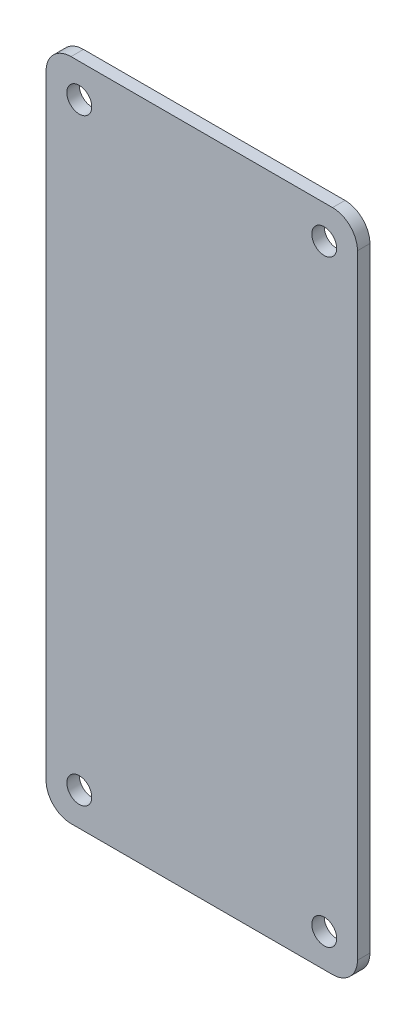
ISO-10303-21;
HEADER;
FILE_DESCRIPTION(('STEP AP214'),'2;1');
FILE_NAME('part.step','',(''),(''),'','','');
FILE_SCHEMA(('AUTOMOTIVE_DESIGN { 1 0 10303 214 1 1 1 1 }'));
ENDSEC;
DATA;
#1=APPLICATION_CONTEXT('core data for automotive mechanical design processes');
#2=APPLICATION_PROTOCOL_DEFINITION('international standard','automotive_design',2000,#1);
#3=PRODUCT_CONTEXT('',#1,'mechanical');
#4=PRODUCT('Part','Part','',(#3));
#5=PRODUCT_RELATED_PRODUCT_CATEGORY('part','',(#4));
#6=PRODUCT_DEFINITION_FORMATION('','',#4);
#7=PRODUCT_DEFINITION_CONTEXT('part definition',#1,'design');
#8=PRODUCT_DEFINITION('design','',#6,#7);
#9=PRODUCT_DEFINITION_SHAPE('','',#8);
#10=(LENGTH_UNIT() NAMED_UNIT(*) SI_UNIT(.MILLI.,.METRE.));
#11=(NAMED_UNIT(*) PLANE_ANGLE_UNIT() SI_UNIT($,.RADIAN.));
#12=(NAMED_UNIT(*) SI_UNIT($,.STERADIAN.) SOLID_ANGLE_UNIT());
#13=UNCERTAINTY_MEASURE_WITH_UNIT(LENGTH_MEASURE(1.E-05),#10,'distance_accuracy_value','');
#14=(GEOMETRIC_REPRESENTATION_CONTEXT(3) GLOBAL_UNCERTAINTY_ASSIGNED_CONTEXT((#13)) GLOBAL_UNIT_ASSIGNED_CONTEXT((#10,
#11,#12)) REPRESENTATION_CONTEXT('',''));
#15=CARTESIAN_POINT('',(0.,0.,0.));
#16=DIRECTION('',(0.,0.,1.));
#17=DIRECTION('',(1.,0.,0.));
#18=AXIS2_PLACEMENT_3D('',#15,#16,#17);
#19=CARTESIAN_POINT('',(0.,0.,3.));
#20=DIRECTION('',(0.,0.,-1.));
#21=DIRECTION('',(-1.,0.,0.));
#22=AXIS2_PLACEMENT_3D('',#19,#20,#21);
#23=PLANE('',#22);
#24=DIRECTION('',(0.,-1.,0.));
#25=VECTOR('',#24,1.);
#26=CARTESIAN_POINT('',(-37.5,80.,3.));
#27=LINE('',#26,#25);
#28=CARTESIAN_POINT('',(-37.5,74.,3.));
#29=VERTEX_POINT('',#28);
#30=CARTESIAN_POINT('',(-37.5,-74.,3.));
#31=VERTEX_POINT('',#30);
#32=EDGE_CURVE('E137',#29,#31,#27,.T.);
#33=ORIENTED_EDGE('',*,*,#32,.T.);
#34=CARTESIAN_POINT('',(-31.5,-74.,3.));
#35=DIRECTION('',(0.,0.,-1.));
#36=DIRECTION('',(-1.,0.,0.));
#37=AXIS2_PLACEMENT_3D('',#34,#35,#36);
#38=CIRCLE('',#37,6.);
#39=CARTESIAN_POINT('',(-31.5,-80.,3.));
#40=VERTEX_POINT('',#39);
#41=EDGE_CURVE('E152',#31,#40,#38,.F.);
#42=ORIENTED_EDGE('',*,*,#41,.T.);
#43=DIRECTION('',(1.,0.,0.));
#44=VECTOR('',#43,1.);
#45=CARTESIAN_POINT('',(37.5,-80.,3.));
#46=LINE('',#45,#44);
#47=CARTESIAN_POINT('',(31.5,-80.,3.));
#48=VERTEX_POINT('',#47);
#49=EDGE_CURVE('E119',#40,#48,#46,.T.);
#50=ORIENTED_EDGE('',*,*,#49,.T.);
#51=CARTESIAN_POINT('',(31.5,-74.,3.));
#52=DIRECTION('',(0.,0.,-1.));
#53=DIRECTION('',(-1.,0.,0.));
#54=AXIS2_PLACEMENT_3D('',#51,#52,#53);
#55=CIRCLE('',#54,6.);
#56=CARTESIAN_POINT('',(37.5,-74.,3.));
#57=VERTEX_POINT('',#56);
#58=EDGE_CURVE('E147',#48,#57,#55,.F.);
#59=ORIENTED_EDGE('',*,*,#58,.T.);
#60=DIRECTION('',(0.,1.,0.));
#61=VECTOR('',#60,1.);
#62=CARTESIAN_POINT('',(37.5,80.,3.));
#63=LINE('',#62,#61);
#64=CARTESIAN_POINT('',(37.5,74.,3.));
#65=VERTEX_POINT('',#64);
#66=EDGE_CURVE('E163',#57,#65,#63,.T.);
#67=ORIENTED_EDGE('',*,*,#66,.T.);
#68=CARTESIAN_POINT('',(31.5,74.,3.));
#69=DIRECTION('',(0.,0.,-1.));
#70=DIRECTION('',(-1.,0.,0.));
#71=AXIS2_PLACEMENT_3D('',#68,#69,#70);
#72=CIRCLE('',#71,6.);
#73=CARTESIAN_POINT('',(31.5,80.,3.));
#74=VERTEX_POINT('',#73);
#75=EDGE_CURVE('E55',#65,#74,#72,.F.);
#76=ORIENTED_EDGE('',*,*,#75,.T.);
#77=DIRECTION('',(-1.,0.,0.));
#78=VECTOR('',#77,1.);
#79=CARTESIAN_POINT('',(37.5,80.,3.));
#80=LINE('',#79,#78);
#81=CARTESIAN_POINT('',(-31.5,80.,3.));
#82=VERTEX_POINT('',#81);
#83=EDGE_CURVE('E138',#74,#82,#80,.T.);
#84=ORIENTED_EDGE('',*,*,#83,.T.);
#85=CARTESIAN_POINT('',(-31.5,74.,3.));
#86=DIRECTION('',(0.,0.,-1.));
#87=DIRECTION('',(-1.,0.,0.));
#88=AXIS2_PLACEMENT_3D('',#85,#86,#87);
#89=CIRCLE('',#88,6.);
#90=EDGE_CURVE('E150',#82,#29,#89,.F.);
#91=ORIENTED_EDGE('',*,*,#90,.T.);
#92=EDGE_LOOP('',(#33,#42,#50,#59,#67,#76,#84,#91));
#93=FACE_BOUND('',#92,.T.);
#94=CARTESIAN_POINT('',(-29.5,72.,3.));
#95=DIRECTION('',(0.,0.,1.));
#96=DIRECTION('',(1.,0.,0.));
#97=AXIS2_PLACEMENT_3D('',#94,#95,#96);
#98=CIRCLE('',#97,3.);
#99=CARTESIAN_POINT('',(-26.5,72.,3.));
#100=VERTEX_POINT('',#99);
#101=EDGE_CURVE('E132',#100,#100,#98,.T.);
#102=ORIENTED_EDGE('',*,*,#101,.F.);
#103=EDGE_LOOP('',(#102));
#104=FACE_BOUND('',#103,.T.);
#105=CARTESIAN_POINT('',(29.5,72.,3.));
#106=DIRECTION('',(0.,0.,1.));
#107=DIRECTION('',(-1.,0.,0.));
#108=AXIS2_PLACEMENT_3D('',#105,#106,#107);
#109=CIRCLE('',#108,3.);
#110=CARTESIAN_POINT('',(26.5,72.,3.));
#111=VERTEX_POINT('',#110);
#112=EDGE_CURVE('E180',#111,#111,#109,.T.);
#113=ORIENTED_EDGE('',*,*,#112,.F.);
#114=EDGE_LOOP('',(#113));
#115=FACE_BOUND('',#114,.T.);
#116=CARTESIAN_POINT('',(-29.5,-72.,3.));
#117=DIRECTION('',(0.,0.,1.));
#118=DIRECTION('',(-1.,0.,0.));
#119=AXIS2_PLACEMENT_3D('',#116,#117,#118);
#120=CIRCLE('',#119,3.);
#121=CARTESIAN_POINT('',(-32.5,-72.,3.));
#122=VERTEX_POINT('',#121);
#123=EDGE_CURVE('E186',#122,#122,#120,.T.);
#124=ORIENTED_EDGE('',*,*,#123,.F.);
#125=EDGE_LOOP('',(#124));
#126=FACE_BOUND('',#125,.T.);
#127=CARTESIAN_POINT('',(29.5,-72.,3.));
#128=DIRECTION('',(0.,0.,1.));
#129=DIRECTION('',(1.,0.,0.));
#130=AXIS2_PLACEMENT_3D('',#127,#128,#129);
#131=CIRCLE('',#130,3.);
#132=CARTESIAN_POINT('',(32.5,-72.,3.));
#133=VERTEX_POINT('',#132);
#134=EDGE_CURVE('E192',#133,#133,#131,.T.);
#135=ORIENTED_EDGE('',*,*,#134,.F.);
#136=EDGE_LOOP('',(#135));
#137=FACE_BOUND('',#136,.T.);
#138=ADVANCED_FACE('F33',(#93,#104,#115,#126,#137),#23,.F.);
#139=CARTESIAN_POINT('',(0.,0.,0.));
#140=DIRECTION('',(0.,0.,-1.));
#141=DIRECTION('',(-1.,0.,0.));
#142=AXIS2_PLACEMENT_3D('',#139,#140,#141);
#143=PLANE('',#142);
#144=CARTESIAN_POINT('',(-29.5,-72.,0.));
#145=DIRECTION('',(0.,0.,1.));
#146=DIRECTION('',(-1.,0.,0.));
#147=AXIS2_PLACEMENT_3D('',#144,#145,#146);
#148=CIRCLE('',#147,3.);
#149=CARTESIAN_POINT('',(-32.5,-72.,0.));
#150=VERTEX_POINT('',#149);
#151=EDGE_CURVE('E189',#150,#150,#148,.T.);
#152=ORIENTED_EDGE('',*,*,#151,.T.);
#153=EDGE_LOOP('',(#152));
#154=FACE_BOUND('',#153,.T.);
#155=CARTESIAN_POINT('',(-29.5,72.,0.));
#156=DIRECTION('',(0.,0.,1.));
#157=DIRECTION('',(1.,0.,0.));
#158=AXIS2_PLACEMENT_3D('',#155,#156,#157);
#159=CIRCLE('',#158,3.);
#160=CARTESIAN_POINT('',(-26.5,72.,0.));
#161=VERTEX_POINT('',#160);
#162=EDGE_CURVE('E177',#161,#161,#159,.T.);
#163=ORIENTED_EDGE('',*,*,#162,.T.);
#164=EDGE_LOOP('',(#163));
#165=FACE_BOUND('',#164,.T.);
#166=DIRECTION('',(1.,0.,0.));
#167=VECTOR('',#166,1.);
#168=CARTESIAN_POINT('',(37.5,-80.,0.));
#169=LINE('',#168,#167);
#170=CARTESIAN_POINT('',(-31.5,-80.,0.));
#171=VERTEX_POINT('',#170);
#172=CARTESIAN_POINT('',(31.5,-80.,0.));
#173=VERTEX_POINT('',#172);
#174=EDGE_CURVE('E116',#171,#173,#169,.T.);
#175=ORIENTED_EDGE('',*,*,#174,.F.);
#176=CARTESIAN_POINT('',(-31.5,-74.,0.));
#177=DIRECTION('',(0.,0.,-1.));
#178=DIRECTION('',(-1.,0.,0.));
#179=AXIS2_PLACEMENT_3D('',#176,#177,#178);
#180=CIRCLE('',#179,6.);
#181=CARTESIAN_POINT('',(-37.5,-74.,0.));
#182=VERTEX_POINT('',#181);
#183=EDGE_CURVE('E99',#171,#182,#180,.T.);
#184=ORIENTED_EDGE('',*,*,#183,.T.);
#185=DIRECTION('',(0.,-1.,0.));
#186=VECTOR('',#185,1.);
#187=CARTESIAN_POINT('',(-37.5,80.,0.));
#188=LINE('',#187,#186);
#189=CARTESIAN_POINT('',(-37.5,74.,0.));
#190=VERTEX_POINT('',#189);
#191=EDGE_CURVE('E127',#190,#182,#188,.T.);
#192=ORIENTED_EDGE('',*,*,#191,.F.);
#193=CARTESIAN_POINT('',(-31.5,74.,0.));
#194=DIRECTION('',(0.,0.,-1.));
#195=DIRECTION('',(-1.,0.,0.));
#196=AXIS2_PLACEMENT_3D('',#193,#194,#195);
#197=CIRCLE('',#196,6.);
#198=CARTESIAN_POINT('',(-31.5,80.,0.));
#199=VERTEX_POINT('',#198);
#200=EDGE_CURVE('E110',#190,#199,#197,.T.);
#201=ORIENTED_EDGE('',*,*,#200,.T.);
#202=DIRECTION('',(-1.,0.,0.));
#203=VECTOR('',#202,1.);
#204=CARTESIAN_POINT('',(37.5,80.,0.));
#205=LINE('',#204,#203);
#206=CARTESIAN_POINT('',(31.5,80.,0.));
#207=VERTEX_POINT('',#206);
#208=EDGE_CURVE('E130',#207,#199,#205,.T.);
#209=ORIENTED_EDGE('',*,*,#208,.F.);
#210=CARTESIAN_POINT('',(31.5,74.,0.));
#211=DIRECTION('',(0.,0.,-1.));
#212=DIRECTION('',(-1.,0.,0.));
#213=AXIS2_PLACEMENT_3D('',#210,#211,#212);
#214=CIRCLE('',#213,6.);
#215=CARTESIAN_POINT('',(37.5,74.,0.));
#216=VERTEX_POINT('',#215);
#217=EDGE_CURVE('E141',#207,#216,#214,.T.);
#218=ORIENTED_EDGE('',*,*,#217,.T.);
#219=DIRECTION('',(0.,1.,0.));
#220=VECTOR('',#219,1.);
#221=CARTESIAN_POINT('',(37.5,80.,0.));
#222=LINE('',#221,#220);
#223=CARTESIAN_POINT('',(37.5,-74.,0.));
#224=VERTEX_POINT('',#223);
#225=EDGE_CURVE('E126',#224,#216,#222,.T.);
#226=ORIENTED_EDGE('',*,*,#225,.F.);
#227=CARTESIAN_POINT('',(31.5,-74.,0.));
#228=DIRECTION('',(0.,0.,-1.));
#229=DIRECTION('',(-1.,0.,0.));
#230=AXIS2_PLACEMENT_3D('',#227,#228,#229);
#231=CIRCLE('',#230,6.);
#232=EDGE_CURVE('E120',#224,#173,#231,.T.);
#233=ORIENTED_EDGE('',*,*,#232,.T.);
#234=EDGE_LOOP('',(#175,#184,#192,#201,#209,#218,#226,#233));
#235=FACE_BOUND('',#234,.T.);
#236=CARTESIAN_POINT('',(29.5,72.,0.));
#237=DIRECTION('',(0.,0.,1.));
#238=DIRECTION('',(-1.,0.,0.));
#239=AXIS2_PLACEMENT_3D('',#236,#237,#238);
#240=CIRCLE('',#239,3.);
#241=CARTESIAN_POINT('',(26.5,72.,0.));
#242=VERTEX_POINT('',#241);
#243=EDGE_CURVE('E183',#242,#242,#240,.T.);
#244=ORIENTED_EDGE('',*,*,#243,.T.);
#245=EDGE_LOOP('',(#244));
#246=FACE_BOUND('',#245,.T.);
#247=CARTESIAN_POINT('',(29.5,-72.,0.));
#248=DIRECTION('',(0.,0.,1.));
#249=DIRECTION('',(1.,0.,0.));
#250=AXIS2_PLACEMENT_3D('',#247,#248,#249);
#251=CIRCLE('',#250,3.);
#252=CARTESIAN_POINT('',(32.5,-72.,0.));
#253=VERTEX_POINT('',#252);
#254=EDGE_CURVE('E195',#253,#253,#251,.T.);
#255=ORIENTED_EDGE('',*,*,#254,.T.);
#256=EDGE_LOOP('',(#255));
#257=FACE_BOUND('',#256,.T.);
#258=ADVANCED_FACE('F123',(#154,#165,#235,#246,#257),#143,.T.);
#259=CARTESIAN_POINT('',(-37.5,80.,3.));
#260=DIRECTION('',(1.,0.,0.));
#261=DIRECTION('',(0.,1.,0.));
#262=AXIS2_PLACEMENT_3D('',#259,#260,#261);
#263=PLANE('',#262);
#264=ORIENTED_EDGE('',*,*,#191,.T.);
#265=DIRECTION('',(0.,0.,-1.));
#266=VECTOR('',#265,1.);
#267=CARTESIAN_POINT('',(-37.5,-74.,3.));
#268=LINE('',#267,#266);
#269=EDGE_CURVE('E104',#182,#31,#268,.F.);
#270=ORIENTED_EDGE('',*,*,#269,.T.);
#271=ORIENTED_EDGE('',*,*,#32,.F.);
#272=DIRECTION('',(0.,0.,-1.));
#273=VECTOR('',#272,1.);
#274=CARTESIAN_POINT('',(-37.5,74.,3.));
#275=LINE('',#274,#273);
#276=EDGE_CURVE('E109',#29,#190,#275,.T.);
#277=ORIENTED_EDGE('',*,*,#276,.T.);
#278=EDGE_LOOP('',(#264,#270,#271,#277));
#279=FACE_BOUND('',#278,.T.);
#280=ADVANCED_FACE('F209',(#279),#263,.F.);
#281=CARTESIAN_POINT('',(37.5,-80.,3.));
#282=DIRECTION('',(0.,1.,0.));
#283=DIRECTION('',(-1.,0.,0.));
#284=AXIS2_PLACEMENT_3D('',#281,#282,#283);
#285=PLANE('',#284);
#286=ORIENTED_EDGE('',*,*,#49,.F.);
#287=DIRECTION('',(0.,0.,-1.));
#288=VECTOR('',#287,1.);
#289=CARTESIAN_POINT('',(-31.5,-80.,3.));
#290=LINE('',#289,#288);
#291=EDGE_CURVE('E103',#40,#171,#290,.T.);
#292=ORIENTED_EDGE('',*,*,#291,.T.);
#293=ORIENTED_EDGE('',*,*,#174,.T.);
#294=DIRECTION('',(0.,0.,-1.));
#295=VECTOR('',#294,1.);
#296=CARTESIAN_POINT('',(31.5,-80.,3.));
#297=LINE('',#296,#295);
#298=EDGE_CURVE('E121',#173,#48,#297,.F.);
#299=ORIENTED_EDGE('',*,*,#298,.T.);
#300=EDGE_LOOP('',(#286,#292,#293,#299));
#301=FACE_BOUND('',#300,.T.);
#302=ADVANCED_FACE('F115',(#301),#285,.F.);
#303=CARTESIAN_POINT('',(37.5,80.,3.));
#304=DIRECTION('',(-1.,0.,0.));
#305=DIRECTION('',(0.,-1.,0.));
#306=AXIS2_PLACEMENT_3D('',#303,#304,#305);
#307=PLANE('',#306);
#308=ORIENTED_EDGE('',*,*,#225,.T.);
#309=DIRECTION('',(0.,0.,-1.));
#310=VECTOR('',#309,1.);
#311=CARTESIAN_POINT('',(37.5,74.,3.));
#312=LINE('',#311,#310);
#313=EDGE_CURVE('E11',#216,#65,#312,.F.);
#314=ORIENTED_EDGE('',*,*,#313,.T.);
#315=ORIENTED_EDGE('',*,*,#66,.F.);
#316=DIRECTION('',(0.,0.,-1.));
#317=VECTOR('',#316,1.);
#318=CARTESIAN_POINT('',(37.5,-74.,3.));
#319=LINE('',#318,#317);
#320=EDGE_CURVE('E41',#57,#224,#319,.T.);
#321=ORIENTED_EDGE('',*,*,#320,.T.);
#322=EDGE_LOOP('',(#308,#314,#315,#321));
#323=FACE_BOUND('',#322,.T.);
#324=ADVANCED_FACE('F161',(#323),#307,.F.);
#325=CARTESIAN_POINT('',(37.5,80.,3.));
#326=DIRECTION('',(0.,-1.,0.));
#327=DIRECTION('',(0.,0.,-1.));
#328=AXIS2_PLACEMENT_3D('',#325,#326,#327);
#329=PLANE('',#328);
#330=ORIENTED_EDGE('',*,*,#208,.T.);
#331=DIRECTION('',(0.,0.,-1.));
#332=VECTOR('',#331,1.);
#333=CARTESIAN_POINT('',(-31.5,80.,3.));
#334=LINE('',#333,#332);
#335=EDGE_CURVE('E48',#199,#82,#334,.F.);
#336=ORIENTED_EDGE('',*,*,#335,.T.);
#337=ORIENTED_EDGE('',*,*,#83,.F.);
#338=DIRECTION('',(0.,0.,-1.));
#339=VECTOR('',#338,1.);
#340=CARTESIAN_POINT('',(31.5,80.,3.));
#341=LINE('',#340,#339);
#342=EDGE_CURVE('E154',#74,#207,#341,.T.);
#343=ORIENTED_EDGE('',*,*,#342,.T.);
#344=EDGE_LOOP('',(#330,#336,#337,#343));
#345=FACE_BOUND('',#344,.T.);
#346=ADVANCED_FACE('F170',(#345),#329,.F.);
#347=CARTESIAN_POINT('',(-29.5,72.,3.));
#348=DIRECTION('',(0.,0.,-1.));
#349=DIRECTION('',(-1.,0.,0.));
#350=AXIS2_PLACEMENT_3D('',#347,#348,#349);
#351=CYLINDRICAL_SURFACE('',#350,3.);
#352=ORIENTED_EDGE('',*,*,#101,.T.);
#353=EDGE_LOOP('',(#352));
#354=FACE_BOUND('',#353,.T.);
#355=ORIENTED_EDGE('',*,*,#162,.F.);
#356=EDGE_LOOP('',(#355));
#357=FACE_BOUND('',#356,.T.);
#358=ADVANCED_FACE('F214',(#354,#357),#351,.F.);
#359=CARTESIAN_POINT('',(29.5,72.,3.));
#360=DIRECTION('',(0.,0.,-1.));
#361=DIRECTION('',(-1.,0.,0.));
#362=AXIS2_PLACEMENT_3D('',#359,#360,#361);
#363=CYLINDRICAL_SURFACE('',#362,3.);
#364=ORIENTED_EDGE('',*,*,#112,.T.);
#365=EDGE_LOOP('',(#364));
#366=FACE_BOUND('',#365,.T.);
#367=ORIENTED_EDGE('',*,*,#243,.F.);
#368=EDGE_LOOP('',(#367));
#369=FACE_BOUND('',#368,.T.);
#370=ADVANCED_FACE('F309',(#366,#369),#363,.F.);
#371=CARTESIAN_POINT('',(-29.5,-72.,3.));
#372=DIRECTION('',(0.,0.,-1.));
#373=DIRECTION('',(-1.,0.,0.));
#374=AXIS2_PLACEMENT_3D('',#371,#372,#373);
#375=CYLINDRICAL_SURFACE('',#374,3.);
#376=ORIENTED_EDGE('',*,*,#123,.T.);
#377=EDGE_LOOP('',(#376));
#378=FACE_BOUND('',#377,.T.);
#379=ORIENTED_EDGE('',*,*,#151,.F.);
#380=EDGE_LOOP('',(#379));
#381=FACE_BOUND('',#380,.T.);
#382=ADVANCED_FACE('F300',(#378,#381),#375,.F.);
#383=CARTESIAN_POINT('',(29.5,-72.,3.));
#384=DIRECTION('',(0.,0.,-1.));
#385=DIRECTION('',(-1.,0.,0.));
#386=AXIS2_PLACEMENT_3D('',#383,#384,#385);
#387=CYLINDRICAL_SURFACE('',#386,3.);
#388=ORIENTED_EDGE('',*,*,#134,.T.);
#389=EDGE_LOOP('',(#388));
#390=FACE_BOUND('',#389,.T.);
#391=ORIENTED_EDGE('',*,*,#254,.F.);
#392=EDGE_LOOP('',(#391));
#393=FACE_BOUND('',#392,.T.);
#394=ADVANCED_FACE('F201',(#390,#393),#387,.F.);
#395=CARTESIAN_POINT('',(-31.5,-74.,3.));
#396=DIRECTION('',(0.,0.,-1.));
#397=DIRECTION('',(-1.,0.,0.));
#398=AXIS2_PLACEMENT_3D('',#395,#396,#397);
#399=CYLINDRICAL_SURFACE('',#398,6.);
#400=ORIENTED_EDGE('',*,*,#41,.F.);
#401=ORIENTED_EDGE('',*,*,#269,.F.);
#402=ORIENTED_EDGE('',*,*,#183,.F.);
#403=ORIENTED_EDGE('',*,*,#291,.F.);
#404=EDGE_LOOP('',(#400,#401,#402,#403));
#405=FACE_BOUND('',#404,.T.);
#406=ADVANCED_FACE('F102',(#405),#399,.T.);
#407=CARTESIAN_POINT('',(-31.5,74.,3.));
#408=DIRECTION('',(0.,0.,-1.));
#409=DIRECTION('',(-1.,0.,0.));
#410=AXIS2_PLACEMENT_3D('',#407,#408,#409);
#411=CYLINDRICAL_SURFACE('',#410,6.);
#412=ORIENTED_EDGE('',*,*,#90,.F.);
#413=ORIENTED_EDGE('',*,*,#335,.F.);
#414=ORIENTED_EDGE('',*,*,#200,.F.);
#415=ORIENTED_EDGE('',*,*,#276,.F.);
#416=EDGE_LOOP('',(#412,#413,#414,#415));
#417=FACE_BOUND('',#416,.T.);
#418=ADVANCED_FACE('F228',(#417),#411,.T.);
#419=CARTESIAN_POINT('',(31.5,74.,3.));
#420=DIRECTION('',(0.,0.,-1.));
#421=DIRECTION('',(-1.,0.,0.));
#422=AXIS2_PLACEMENT_3D('',#419,#420,#421);
#423=CYLINDRICAL_SURFACE('',#422,6.);
#424=ORIENTED_EDGE('',*,*,#75,.F.);
#425=ORIENTED_EDGE('',*,*,#313,.F.);
#426=ORIENTED_EDGE('',*,*,#217,.F.);
#427=ORIENTED_EDGE('',*,*,#342,.F.);
#428=EDGE_LOOP('',(#424,#425,#426,#427));
#429=FACE_BOUND('',#428,.T.);
#430=ADVANCED_FACE('F169',(#429),#423,.T.);
#431=CARTESIAN_POINT('',(31.5,-74.,3.));
#432=DIRECTION('',(0.,0.,-1.));
#433=DIRECTION('',(-1.,0.,0.));
#434=AXIS2_PLACEMENT_3D('',#431,#432,#433);
#435=CYLINDRICAL_SURFACE('',#434,6.);
#436=ORIENTED_EDGE('',*,*,#58,.F.);
#437=ORIENTED_EDGE('',*,*,#298,.F.);
#438=ORIENTED_EDGE('',*,*,#232,.F.);
#439=ORIENTED_EDGE('',*,*,#320,.F.);
#440=EDGE_LOOP('',(#436,#437,#438,#439));
#441=FACE_BOUND('',#440,.T.);
#442=ADVANCED_FACE('F35',(#441),#435,.T.);
#443=CLOSED_SHELL('',(#138,#258,#280,#302,#324,#346,#358,#370,#382,#394,#406,#418,#430,#442));
#444=MANIFOLD_SOLID_BREP('B2',#443);
#445=ADVANCED_BREP_SHAPE_REPRESENTATION('',(#18,#444),#14);
#446=SHAPE_DEFINITION_REPRESENTATION(#9,#445);
ENDSEC;
END-ISO-10303-21;
